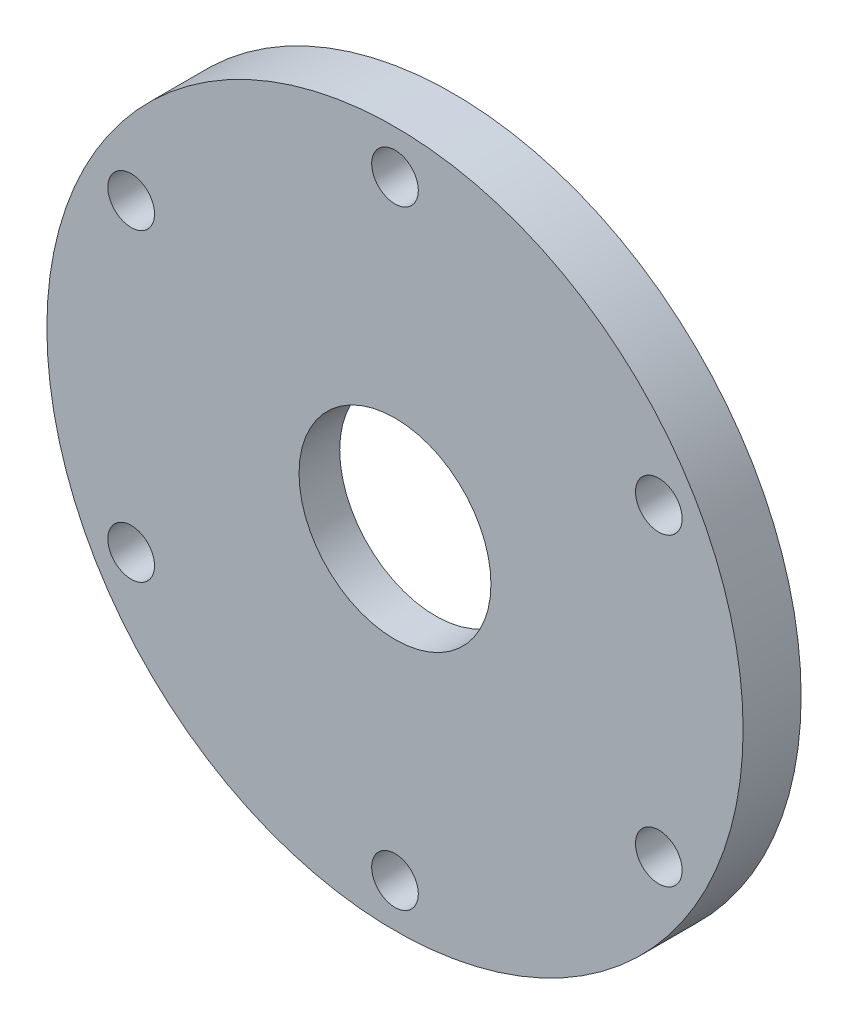
ISO-10303-21;
HEADER;
FILE_DESCRIPTION(('STEP AP214'),'2;1');
FILE_NAME('part.step','',(''),(''),'','','');
FILE_SCHEMA(('AUTOMOTIVE_DESIGN { 1 0 10303 214 1 1 1 1 }'));
ENDSEC;
DATA;
#1=APPLICATION_CONTEXT('core data for automotive mechanical design processes');
#2=APPLICATION_PROTOCOL_DEFINITION('international standard','automotive_design',2000,#1);
#3=PRODUCT_CONTEXT('',#1,'mechanical');
#4=PRODUCT('Part','Part','',(#3));
#5=PRODUCT_RELATED_PRODUCT_CATEGORY('part','',(#4));
#6=PRODUCT_DEFINITION_FORMATION('','',#4);
#7=PRODUCT_DEFINITION_CONTEXT('part definition',#1,'design');
#8=PRODUCT_DEFINITION('design','',#6,#7);
#9=PRODUCT_DEFINITION_SHAPE('','',#8);
#10=(LENGTH_UNIT() NAMED_UNIT(*) SI_UNIT(.MILLI.,.METRE.));
#11=(NAMED_UNIT(*) PLANE_ANGLE_UNIT() SI_UNIT($,.RADIAN.));
#12=(NAMED_UNIT(*) SI_UNIT($,.STERADIAN.) SOLID_ANGLE_UNIT());
#13=UNCERTAINTY_MEASURE_WITH_UNIT(LENGTH_MEASURE(1.E-05),#10,'distance_accuracy_value','');
#14=(GEOMETRIC_REPRESENTATION_CONTEXT(3) GLOBAL_UNCERTAINTY_ASSIGNED_CONTEXT((#13)) GLOBAL_UNIT_ASSIGNED_CONTEXT((#10,
#11,#12)) REPRESENTATION_CONTEXT('',''));
#15=CARTESIAN_POINT('',(0.,0.,0.));
#16=DIRECTION('',(0.,0.,1.));
#17=DIRECTION('',(1.,0.,0.));
#18=AXIS2_PLACEMENT_3D('',#15,#16,#17);
#19=CARTESIAN_POINT('',(0.,0.,3.175));
#20=DIRECTION('',(0.,0.,-1.));
#21=DIRECTION('',(-1.,0.,0.));
#22=AXIS2_PLACEMENT_3D('',#19,#20,#21);
#23=CYLINDRICAL_SURFACE('',#22,10.5);
#24=CARTESIAN_POINT('',(0.,0.,3.175));
#25=DIRECTION('',(0.,0.,1.));
#26=DIRECTION('',(1.,0.,0.));
#27=AXIS2_PLACEMENT_3D('',#24,#25,#26);
#28=CIRCLE('',#27,10.5);
#29=CARTESIAN_POINT('',(10.5,0.,3.175));
#30=VERTEX_POINT('',#29);
#31=EDGE_CURVE('E45',#30,#30,#28,.T.);
#32=ORIENTED_EDGE('',*,*,#31,.T.);
#33=EDGE_LOOP('',(#32));
#34=FACE_BOUND('',#33,.T.);
#35=CARTESIAN_POINT('',(0.,0.,-1.274999952));
#36=DIRECTION('',(0.,0.,-1.));
#37=DIRECTION('',(-1.,0.,0.));
#38=AXIS2_PLACEMENT_3D('',#35,#36,#37);
#39=CIRCLE('',#38,10.5);
#40=CARTESIAN_POINT('',(-10.5,0.,-1.274999952));
#41=VERTEX_POINT('',#40);
#42=EDGE_CURVE('E36',#41,#41,#39,.T.);
#43=ORIENTED_EDGE('',*,*,#42,.T.);
#44=EDGE_LOOP('',(#43));
#45=FACE_BOUND('',#44,.T.);
#46=ADVANCED_FACE('F32',(#34,#45),#23,.F.);
#47=CARTESIAN_POINT('',(0.,0.,3.175));
#48=DIRECTION('',(0.,0.,1.));
#49=DIRECTION('',(1.,0.,0.));
#50=AXIS2_PLACEMENT_3D('',#47,#48,#49);
#51=PLANE('',#50);
#52=CARTESIAN_POINT('',(-28.8711218986637,-16.66875,3.175));
#53=DIRECTION('',(0.,0.,1.));
#54=DIRECTION('',(1.,0.,0.));
#55=AXIS2_PLACEMENT_3D('',#52,#53,#54);
#56=CIRCLE('',#55,2.5527);
#57=CARTESIAN_POINT('',(-26.3184218986637,-16.66875,3.175));
#58=VERTEX_POINT('',#57);
#59=EDGE_CURVE('E62',#58,#58,#56,.T.);
#60=ORIENTED_EDGE('',*,*,#59,.F.);
#61=EDGE_LOOP('',(#60));
#62=FACE_BOUND('',#61,.T.);
#63=CARTESIAN_POINT('',(-2.32794518267366E-13,-33.3375,3.175));
#64=DIRECTION('',(0.,0.,1.));
#65=DIRECTION('',(1.,0.,0.));
#66=AXIS2_PLACEMENT_3D('',#63,#64,#65);
#67=CIRCLE('',#66,2.5527);
#68=CARTESIAN_POINT('',(2.55269999999977,-33.3375,3.175));
#69=VERTEX_POINT('',#68);
#70=EDGE_CURVE('E68',#69,#69,#67,.T.);
#71=ORIENTED_EDGE('',*,*,#70,.F.);
#72=EDGE_LOOP('',(#71));
#73=FACE_BOUND('',#72,.T.);
#74=CARTESIAN_POINT('',(28.8711218986636,-16.6687500000001,3.175));
#75=DIRECTION('',(0.,0.,1.));
#76=DIRECTION('',(1.,0.,0.));
#77=AXIS2_PLACEMENT_3D('',#74,#75,#76);
#78=CIRCLE('',#77,2.5527);
#79=CARTESIAN_POINT('',(31.4238218986636,-16.6687500000001,3.175));
#80=VERTEX_POINT('',#79);
#81=EDGE_CURVE('E74',#80,#80,#78,.T.);
#82=ORIENTED_EDGE('',*,*,#81,.F.);
#83=EDGE_LOOP('',(#82));
#84=FACE_BOUND('',#83,.T.);
#85=CARTESIAN_POINT('',(28.8711218986638,16.6687499999999,3.175));
#86=DIRECTION('',(0.,0.,1.));
#87=DIRECTION('',(1.,0.,0.));
#88=AXIS2_PLACEMENT_3D('',#85,#86,#87);
#89=CIRCLE('',#88,2.5527);
#90=CARTESIAN_POINT('',(31.4238218986638,16.6687499999999,3.175));
#91=VERTEX_POINT('',#90);
#92=EDGE_CURVE('E80',#91,#91,#89,.T.);
#93=ORIENTED_EDGE('',*,*,#92,.F.);
#94=EDGE_LOOP('',(#93));
#95=FACE_BOUND('',#94,.T.);
#96=CARTESIAN_POINT('',(0.,33.3375,3.175));
#97=DIRECTION('',(0.,0.,1.));
#98=DIRECTION('',(1.,0.,0.));
#99=AXIS2_PLACEMENT_3D('',#96,#97,#98);
#100=CIRCLE('',#99,2.5527);
#101=CARTESIAN_POINT('',(2.5527,33.3375,3.175));
#102=VERTEX_POINT('',#101);
#103=EDGE_CURVE('E86',#102,#102,#100,.T.);
#104=ORIENTED_EDGE('',*,*,#103,.F.);
#105=EDGE_LOOP('',(#104));
#106=FACE_BOUND('',#105,.T.);
#107=CARTESIAN_POINT('',(-28.8711218986635,16.6687500000003,3.175));
#108=DIRECTION('',(0.,0.,1.));
#109=DIRECTION('',(1.,0.,0.));
#110=AXIS2_PLACEMENT_3D('',#107,#108,#109);
#111=CIRCLE('',#110,2.5527);
#112=CARTESIAN_POINT('',(-26.3184218986635,16.6687500000003,3.175));
#113=VERTEX_POINT('',#112);
#114=EDGE_CURVE('E56',#113,#113,#111,.T.);
#115=ORIENTED_EDGE('',*,*,#114,.F.);
#116=EDGE_LOOP('',(#115));
#117=FACE_BOUND('',#116,.T.);
#118=CARTESIAN_POINT('',(0.,0.,3.175));
#119=DIRECTION('',(0.,0.,1.));
#120=DIRECTION('',(1.,0.,0.));
#121=AXIS2_PLACEMENT_3D('',#118,#119,#120);
#122=CIRCLE('',#121,38.1);
#123=CARTESIAN_POINT('',(38.1,0.,3.175));
#124=VERTEX_POINT('',#123);
#125=EDGE_CURVE('E10',#124,#124,#122,.T.);
#126=ORIENTED_EDGE('',*,*,#125,.T.);
#127=EDGE_LOOP('',(#126));
#128=FACE_BOUND('',#127,.T.);
#129=ORIENTED_EDGE('',*,*,#31,.F.);
#130=EDGE_LOOP('',(#129));
#131=FACE_BOUND('',#130,.T.);
#132=ADVANCED_FACE('F113',(#62,#73,#84,#95,#106,#117,#128,#131),#51,.T.);
#133=CARTESIAN_POINT('',(0.,0.,-3.175));
#134=DIRECTION('',(0.,0.,1.));
#135=DIRECTION('',(1.,0.,0.));
#136=AXIS2_PLACEMENT_3D('',#133,#134,#135);
#137=PLANE('',#136);
#138=CARTESIAN_POINT('',(-28.8711218986637,-16.66875,-3.175));
#139=DIRECTION('',(0.,0.,1.));
#140=DIRECTION('',(1.,0.,0.));
#141=AXIS2_PLACEMENT_3D('',#138,#139,#140);
#142=CIRCLE('',#141,2.5527);
#143=CARTESIAN_POINT('',(-26.3184218986637,-16.66875,-3.175));
#144=VERTEX_POINT('',#143);
#145=EDGE_CURVE('E65',#144,#144,#142,.T.);
#146=ORIENTED_EDGE('',*,*,#145,.T.);
#147=EDGE_LOOP('',(#146));
#148=FACE_BOUND('',#147,.T.);
#149=CARTESIAN_POINT('',(-2.32794518267366E-13,-33.3375,-3.175));
#150=DIRECTION('',(0.,0.,1.));
#151=DIRECTION('',(1.,0.,0.));
#152=AXIS2_PLACEMENT_3D('',#149,#150,#151);
#153=CIRCLE('',#152,2.5527);
#154=CARTESIAN_POINT('',(2.55269999999977,-33.3375,-3.175));
#155=VERTEX_POINT('',#154);
#156=EDGE_CURVE('E71',#155,#155,#153,.T.);
#157=ORIENTED_EDGE('',*,*,#156,.T.);
#158=EDGE_LOOP('',(#157));
#159=FACE_BOUND('',#158,.T.);
#160=CARTESIAN_POINT('',(28.8711218986636,-16.6687500000001,-3.175));
#161=DIRECTION('',(0.,0.,1.));
#162=DIRECTION('',(1.,0.,0.));
#163=AXIS2_PLACEMENT_3D('',#160,#161,#162);
#164=CIRCLE('',#163,2.5527);
#165=CARTESIAN_POINT('',(31.4238218986636,-16.6687500000001,-3.175));
#166=VERTEX_POINT('',#165);
#167=EDGE_CURVE('E77',#166,#166,#164,.T.);
#168=ORIENTED_EDGE('',*,*,#167,.T.);
#169=EDGE_LOOP('',(#168));
#170=FACE_BOUND('',#169,.T.);
#171=CARTESIAN_POINT('',(28.8711218986638,16.6687499999999,-3.175));
#172=DIRECTION('',(0.,0.,1.));
#173=DIRECTION('',(1.,0.,0.));
#174=AXIS2_PLACEMENT_3D('',#171,#172,#173);
#175=CIRCLE('',#174,2.5527);
#176=CARTESIAN_POINT('',(31.4238218986638,16.6687499999999,-3.175));
#177=VERTEX_POINT('',#176);
#178=EDGE_CURVE('E83',#177,#177,#175,.T.);
#179=ORIENTED_EDGE('',*,*,#178,.T.);
#180=EDGE_LOOP('',(#179));
#181=FACE_BOUND('',#180,.T.);
#182=CARTESIAN_POINT('',(0.,33.3375,-3.175));
#183=DIRECTION('',(0.,0.,1.));
#184=DIRECTION('',(1.,0.,0.));
#185=AXIS2_PLACEMENT_3D('',#182,#183,#184);
#186=CIRCLE('',#185,2.5527);
#187=CARTESIAN_POINT('',(2.5527,33.3375,-3.175));
#188=VERTEX_POINT('',#187);
#189=EDGE_CURVE('E59',#188,#188,#186,.T.);
#190=ORIENTED_EDGE('',*,*,#189,.T.);
#191=EDGE_LOOP('',(#190));
#192=FACE_BOUND('',#191,.T.);
#193=CARTESIAN_POINT('',(-28.8711218986635,16.6687500000003,-3.175));
#194=DIRECTION('',(0.,0.,1.));
#195=DIRECTION('',(1.,0.,0.));
#196=AXIS2_PLACEMENT_3D('',#193,#194,#195);
#197=CIRCLE('',#196,2.5527);
#198=CARTESIAN_POINT('',(-26.3184218986635,16.6687500000003,-3.175));
#199=VERTEX_POINT('',#198);
#200=EDGE_CURVE('E53',#199,#199,#197,.T.);
#201=ORIENTED_EDGE('',*,*,#200,.T.);
#202=EDGE_LOOP('',(#201));
#203=FACE_BOUND('',#202,.T.);
#204=CARTESIAN_POINT('',(0.,0.,-3.175));
#205=DIRECTION('',(0.,0.,-1.));
#206=DIRECTION('',(-1.,0.,0.));
#207=AXIS2_PLACEMENT_3D('',#204,#205,#206);
#208=CIRCLE('',#207,17.75000006);
#209=CARTESIAN_POINT('',(-17.75000006,0.,-3.175));
#210=VERTEX_POINT('',#209);
#211=EDGE_CURVE('E50',#210,#210,#208,.T.);
#212=ORIENTED_EDGE('',*,*,#211,.F.);
#213=EDGE_LOOP('',(#212));
#214=FACE_BOUND('',#213,.T.);
#215=CARTESIAN_POINT('',(0.,0.,-3.175));
#216=DIRECTION('',(0.,0.,1.));
#217=DIRECTION('',(1.,0.,0.));
#218=AXIS2_PLACEMENT_3D('',#215,#216,#217);
#219=CIRCLE('',#218,38.1);
#220=CARTESIAN_POINT('',(38.1,0.,-3.175));
#221=VERTEX_POINT('',#220);
#222=EDGE_CURVE('E40',#221,#221,#219,.T.);
#223=ORIENTED_EDGE('',*,*,#222,.F.);
#224=EDGE_LOOP('',(#223));
#225=FACE_BOUND('',#224,.T.);
#226=ADVANCED_FACE('F119',(#148,#159,#170,#181,#192,#203,#214,#225),#137,.F.);
#227=CARTESIAN_POINT('',(0.,0.,3.175));
#228=DIRECTION('',(0.,0.,-1.));
#229=DIRECTION('',(-1.,0.,0.));
#230=AXIS2_PLACEMENT_3D('',#227,#228,#229);
#231=CYLINDRICAL_SURFACE('',#230,38.1);
#232=ORIENTED_EDGE('',*,*,#125,.F.);
#233=EDGE_LOOP('',(#232));
#234=FACE_BOUND('',#233,.T.);
#235=ORIENTED_EDGE('',*,*,#222,.T.);
#236=EDGE_LOOP('',(#235));
#237=FACE_BOUND('',#236,.T.);
#238=ADVANCED_FACE('F34',(#234,#237),#231,.T.);
#239=CARTESIAN_POINT('',(0.,0.,-1.674999952));
#240=DIRECTION('',(0.,0.,-1.));
#241=DIRECTION('',(-1.,0.,0.));
#242=AXIS2_PLACEMENT_3D('',#239,#240,#241);
#243=CYLINDRICAL_SURFACE('',#242,17.75000006);
#244=CARTESIAN_POINT('',(0.,0.,-1.674999952));
#245=DIRECTION('',(0.,0.,-1.));
#246=DIRECTION('',(-1.,0.,0.));
#247=AXIS2_PLACEMENT_3D('',#244,#245,#246);
#248=CIRCLE('',#247,17.75000006);
#249=CARTESIAN_POINT('',(-17.75000006,0.,-1.674999952));
#250=VERTEX_POINT('',#249);
#251=EDGE_CURVE('E49',#250,#250,#248,.T.);
#252=ORIENTED_EDGE('',*,*,#251,.F.);
#253=EDGE_LOOP('',(#252));
#254=FACE_BOUND('',#253,.T.);
#255=ORIENTED_EDGE('',*,*,#211,.T.);
#256=EDGE_LOOP('',(#255));
#257=FACE_BOUND('',#256,.T.);
#258=ADVANCED_FACE('F123',(#254,#257),#243,.F.);
#259=CARTESIAN_POINT('',(0.,0.,-1.674999952));
#260=DIRECTION('',(0.,0.,-1.));
#261=DIRECTION('',(-1.,0.,0.));
#262=AXIS2_PLACEMENT_3D('',#259,#260,#261);
#263=PLANE('',#262);
#264=CARTESIAN_POINT('',(0.,0.,-1.674999952));
#265=DIRECTION('',(0.,0.,-1.));
#266=DIRECTION('',(-1.,0.,0.));
#267=AXIS2_PLACEMENT_3D('',#264,#265,#266);
#268=CIRCLE('',#267,14.09889992);
#269=CARTESIAN_POINT('',(-14.09889992,0.,-1.674999952));
#270=VERTEX_POINT('',#269);
#271=EDGE_CURVE('E91',#270,#270,#268,.T.);
#272=ORIENTED_EDGE('',*,*,#271,.F.);
#273=EDGE_LOOP('',(#272));
#274=FACE_BOUND('',#273,.T.);
#275=ORIENTED_EDGE('',*,*,#251,.T.);
#276=EDGE_LOOP('',(#275));
#277=FACE_BOUND('',#276,.T.);
#278=ADVANCED_FACE('F149',(#274,#277),#263,.T.);
#279=CARTESIAN_POINT('',(-28.8711218986635,16.6687500000003,-3.175));
#280=DIRECTION('',(0.,0.,1.));
#281=DIRECTION('',(1.,0.,0.));
#282=AXIS2_PLACEMENT_3D('',#279,#280,#281);
#283=CYLINDRICAL_SURFACE('',#282,2.5527);
#284=ORIENTED_EDGE('',*,*,#200,.F.);
#285=EDGE_LOOP('',(#284));
#286=FACE_BOUND('',#285,.T.);
#287=ORIENTED_EDGE('',*,*,#114,.T.);
#288=EDGE_LOOP('',(#287));
#289=FACE_BOUND('',#288,.T.);
#290=ADVANCED_FACE('F154',(#286,#289),#283,.F.);
#291=CARTESIAN_POINT('',(0.,33.3375,-3.175));
#292=DIRECTION('',(0.,0.,1.));
#293=DIRECTION('',(1.,0.,0.));
#294=AXIS2_PLACEMENT_3D('',#291,#292,#293);
#295=CYLINDRICAL_SURFACE('',#294,2.5527);
#296=ORIENTED_EDGE('',*,*,#189,.F.);
#297=EDGE_LOOP('',(#296));
#298=FACE_BOUND('',#297,.T.);
#299=ORIENTED_EDGE('',*,*,#103,.T.);
#300=EDGE_LOOP('',(#299));
#301=FACE_BOUND('',#300,.T.);
#302=ADVANCED_FACE('F161',(#298,#301),#295,.F.);
#303=CARTESIAN_POINT('',(28.8711218986638,16.6687499999999,-3.175));
#304=DIRECTION('',(0.,0.,1.));
#305=DIRECTION('',(1.,0.,0.));
#306=AXIS2_PLACEMENT_3D('',#303,#304,#305);
#307=CYLINDRICAL_SURFACE('',#306,2.5527);
#308=ORIENTED_EDGE('',*,*,#178,.F.);
#309=EDGE_LOOP('',(#308));
#310=FACE_BOUND('',#309,.T.);
#311=ORIENTED_EDGE('',*,*,#92,.T.);
#312=EDGE_LOOP('',(#311));
#313=FACE_BOUND('',#312,.T.);
#314=ADVANCED_FACE('F176',(#310,#313),#307,.F.);
#315=CARTESIAN_POINT('',(28.8711218986636,-16.6687500000001,-3.175));
#316=DIRECTION('',(0.,0.,1.));
#317=DIRECTION('',(1.,0.,0.));
#318=AXIS2_PLACEMENT_3D('',#315,#316,#317);
#319=CYLINDRICAL_SURFACE('',#318,2.5527);
#320=ORIENTED_EDGE('',*,*,#167,.F.);
#321=EDGE_LOOP('',(#320));
#322=FACE_BOUND('',#321,.T.);
#323=ORIENTED_EDGE('',*,*,#81,.T.);
#324=EDGE_LOOP('',(#323));
#325=FACE_BOUND('',#324,.T.);
#326=ADVANCED_FACE('F172',(#322,#325),#319,.F.);
#327=CARTESIAN_POINT('',(-2.32794518267366E-13,-33.3375,-3.175));
#328=DIRECTION('',(0.,0.,1.));
#329=DIRECTION('',(1.,0.,0.));
#330=AXIS2_PLACEMENT_3D('',#327,#328,#329);
#331=CYLINDRICAL_SURFACE('',#330,2.5527);
#332=ORIENTED_EDGE('',*,*,#156,.F.);
#333=EDGE_LOOP('',(#332));
#334=FACE_BOUND('',#333,.T.);
#335=ORIENTED_EDGE('',*,*,#70,.T.);
#336=EDGE_LOOP('',(#335));
#337=FACE_BOUND('',#336,.T.);
#338=ADVANCED_FACE('F168',(#334,#337),#331,.F.);
#339=CARTESIAN_POINT('',(-28.8711218986637,-16.66875,-3.175));
#340=DIRECTION('',(0.,0.,1.));
#341=DIRECTION('',(1.,0.,0.));
#342=AXIS2_PLACEMENT_3D('',#339,#340,#341);
#343=CYLINDRICAL_SURFACE('',#342,2.5527);
#344=ORIENTED_EDGE('',*,*,#145,.F.);
#345=EDGE_LOOP('',(#344));
#346=FACE_BOUND('',#345,.T.);
#347=ORIENTED_EDGE('',*,*,#59,.T.);
#348=EDGE_LOOP('',(#347));
#349=FACE_BOUND('',#348,.T.);
#350=ADVANCED_FACE('F109',(#346,#349),#343,.F.);
#351=CARTESIAN_POINT('',(0.,0.,-1.274999952));
#352=DIRECTION('',(0.,0.,-1.));
#353=DIRECTION('',(-1.,0.,0.));
#354=AXIS2_PLACEMENT_3D('',#351,#352,#353);
#355=CYLINDRICAL_SURFACE('',#354,14.09889992);
#356=CARTESIAN_POINT('',(0.,0.,-1.274999952));
#357=DIRECTION('',(0.,0.,-1.));
#358=DIRECTION('',(-1.,0.,0.));
#359=AXIS2_PLACEMENT_3D('',#356,#357,#358);
#360=CIRCLE('',#359,14.09889992);
#361=CARTESIAN_POINT('',(-14.09889992,0.,-1.274999952));
#362=VERTEX_POINT('',#361);
#363=EDGE_CURVE('E94',#362,#362,#360,.T.);
#364=ORIENTED_EDGE('',*,*,#363,.F.);
#365=EDGE_LOOP('',(#364));
#366=FACE_BOUND('',#365,.T.);
#367=ORIENTED_EDGE('',*,*,#271,.T.);
#368=EDGE_LOOP('',(#367));
#369=FACE_BOUND('',#368,.T.);
#370=ADVANCED_FACE('F104',(#366,#369),#355,.F.);
#371=CARTESIAN_POINT('',(0.,0.,-1.274999952));
#372=DIRECTION('',(0.,0.,-1.));
#373=DIRECTION('',(-1.,0.,0.));
#374=AXIS2_PLACEMENT_3D('',#371,#372,#373);
#375=PLANE('',#374);
#376=ORIENTED_EDGE('',*,*,#42,.F.);
#377=EDGE_LOOP('',(#376));
#378=FACE_BOUND('',#377,.T.);
#379=ORIENTED_EDGE('',*,*,#363,.T.);
#380=EDGE_LOOP('',(#379));
#381=FACE_BOUND('',#380,.T.);
#382=ADVANCED_FACE('F102',(#378,#381),#375,.T.);
#383=CLOSED_SHELL('',(#46,#132,#226,#238,#258,#278,#290,#302,#314,#326,#338,#350,#370,#382));
#384=MANIFOLD_SOLID_BREP('B2',#383);
#385=ADVANCED_BREP_SHAPE_REPRESENTATION('',(#18,#384),#14);
#386=SHAPE_DEFINITION_REPRESENTATION(#9,#385);
ENDSEC;
END-ISO-10303-21;
